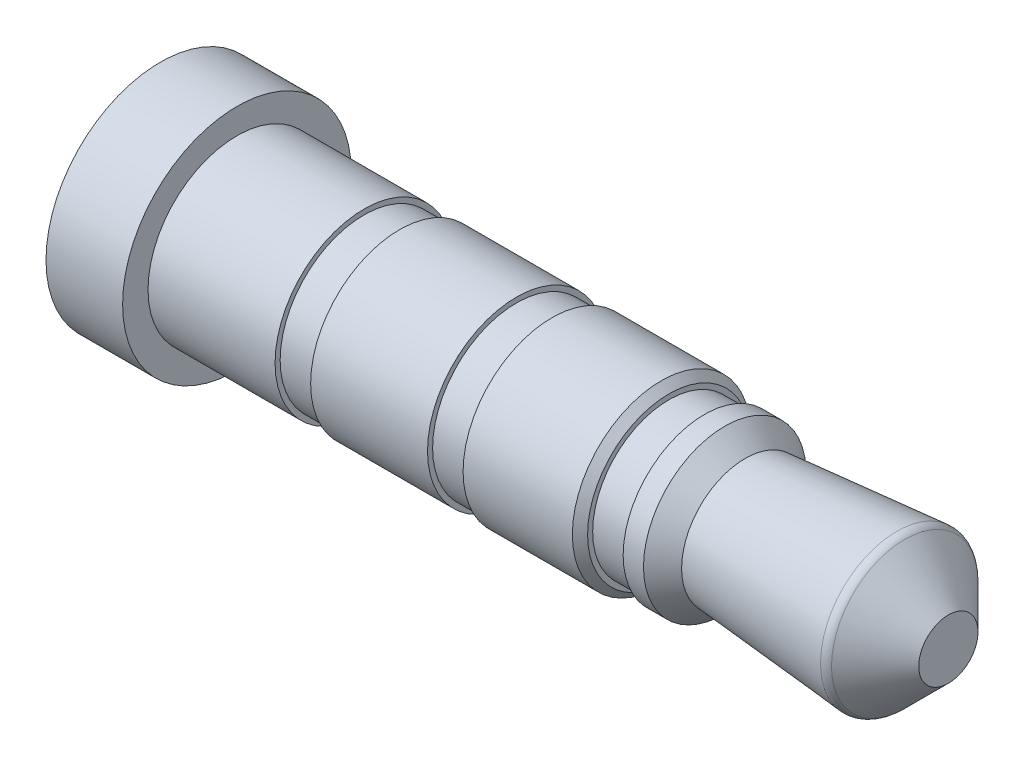
ISO-10303-21;
HEADER;
FILE_DESCRIPTION(('STEP AP214'),'2;1');
FILE_NAME('part.step','',(''),(''),'','','');
FILE_SCHEMA(('AUTOMOTIVE_DESIGN { 1 0 10303 214 1 1 1 1 }'));
ENDSEC;
DATA;
#1=APPLICATION_CONTEXT('core data for automotive mechanical design processes');
#2=APPLICATION_PROTOCOL_DEFINITION('international standard','automotive_design',2000,#1);
#3=PRODUCT_CONTEXT('',#1,'mechanical');
#4=PRODUCT('Part','Part','',(#3));
#5=PRODUCT_RELATED_PRODUCT_CATEGORY('part','',(#4));
#6=PRODUCT_DEFINITION_FORMATION('','',#4);
#7=PRODUCT_DEFINITION_CONTEXT('part definition',#1,'design');
#8=PRODUCT_DEFINITION('design','',#6,#7);
#9=PRODUCT_DEFINITION_SHAPE('','',#8);
#10=(LENGTH_UNIT() NAMED_UNIT(*) SI_UNIT(.MILLI.,.METRE.));
#11=(NAMED_UNIT(*) PLANE_ANGLE_UNIT() SI_UNIT($,.RADIAN.));
#12=(NAMED_UNIT(*) SI_UNIT($,.STERADIAN.) SOLID_ANGLE_UNIT());
#13=UNCERTAINTY_MEASURE_WITH_UNIT(LENGTH_MEASURE(1.E-05),#10,'distance_accuracy_value','');
#14=(GEOMETRIC_REPRESENTATION_CONTEXT(3) GLOBAL_UNCERTAINTY_ASSIGNED_CONTEXT((#13)) GLOBAL_UNIT_ASSIGNED_CONTEXT((#10,
#11,#12)) REPRESENTATION_CONTEXT('',''));
#15=CARTESIAN_POINT('',(0.,0.,0.));
#16=DIRECTION('',(0.,0.,1.));
#17=DIRECTION('',(1.,0.,0.));
#18=AXIS2_PLACEMENT_3D('',#15,#16,#17);
#19=CARTESIAN_POINT('',(-0.5000000000001,3.108578643763,-2.299999999999));
#20=DIRECTION('',(1.,0.,0.));
#21=DIRECTION('',(0.,0.,-1.));
#22=AXIS2_PLACEMENT_3D('',#19,#20,#21);
#23=PLANE('',#22);
#24=CARTESIAN_POINT('',(-0.50000000004502,3.4,-2.299999999999));
#25=DIRECTION('',(-1.,0.,0.));
#26=DIRECTION('',(0.,0.,1.));
#27=AXIS2_PLACEMENT_3D('',#24,#25,#26);
#28=CIRCLE('',#27,0.582842712447837);
#29=CARTESIAN_POINT('',(-0.50000000004502,3.4,-1.71715728755116));
#30=VERTEX_POINT('',#29);
#31=EDGE_CURVE('E18',#30,#30,#28,.T.);
#32=ORIENTED_EDGE('',*,*,#31,.F.);
#33=EDGE_LOOP('',(#32));
#34=FACE_BOUND('',#33,.T.);
#35=ADVANCED_FACE('F15',(#34),#23,.T.);
#36=CARTESIAN_POINT('',(-1.35857864370337,3.4,-2.299999999999));
#37=DIRECTION('',(-1.,0.,0.));
#38=DIRECTION('',(0.,0.,1.));
#39=AXIS2_PLACEMENT_3D('',#36,#37,#38);
#40=CONICAL_SURFACE('',#39,1.44142135604934,0.785398163364345);
#41=ORIENTED_EDGE('',*,*,#31,.T.);
#42=EDGE_LOOP('',(#41));
#43=FACE_BOUND('',#42,.T.);
#44=CARTESIAN_POINT('',(-1.35857864376269,3.4,-2.299999999999));
#45=DIRECTION('',(-1.,0.,0.));
#46=DIRECTION('',(0.,0.,-1.));
#47=AXIS2_PLACEMENT_3D('',#44,#45,#46);
#48=CIRCLE('',#47,1.44142135623731);
#49=CARTESIAN_POINT('',(-1.35857864376269,3.4,-3.74142135623631));
#50=VERTEX_POINT('',#49);
#51=EDGE_CURVE('E30',#50,#50,#48,.T.);
#52=ORIENTED_EDGE('',*,*,#51,.F.);
#53=EDGE_LOOP('',(#52));
#54=FACE_BOUND('',#53,.T.);
#55=ADVANCED_FACE('F90',(#43,#54),#40,.T.);
#56=CARTESIAN_POINT('',(-1.5,3.4,-2.299999999999));
#57=DIRECTION('',(-1.,0.,0.));
#58=DIRECTION('',(0.,0.,-1.));
#59=AXIS2_PLACEMENT_3D('',#56,#57,#58);
#60=TOROIDAL_SURFACE('',#59,1.3,0.2);
#61=ORIENTED_EDGE('',*,*,#51,.T.);
#62=EDGE_LOOP('',(#61));
#63=FACE_BOUND('',#62,.T.);
#64=CARTESIAN_POINT('',(-1.51665508855103,3.4,-2.299999999999));
#65=DIRECTION('',(1.,0.,0.));
#66=DIRECTION('',(0.,-1.,0.));
#67=AXIS2_PLACEMENT_3D('',#64,#65,#66);
#68=CIRCLE('',#67,1.4993053135947);
#69=CARTESIAN_POINT('',(-1.51665508855103,1.9006946864053,-2.299999999999));
#70=VERTEX_POINT('',#69);
#71=EDGE_CURVE('E79',#70,#70,#68,.F.);
#72=ORIENTED_EDGE('',*,*,#71,.F.);
#73=EDGE_LOOP('',(#72));
#74=FACE_BOUND('',#73,.T.);
#75=ADVANCED_FACE('F86',(#63,#74),#60,.T.);
#76=CARTESIAN_POINT('',(-1.51665508866472,3.4,-2.299999999999));
#77=DIRECTION('',(1.,0.,0.));
#78=DIRECTION('',(0.,0.,-1.));
#79=AXIS2_PLACEMENT_3D('',#76,#77,#78);
#80=CONICAL_SURFACE('',#79,1.49930531358049,0.0833719941546523);
#81=ORIENTED_EDGE('',*,*,#71,.T.);
#82=EDGE_LOOP('',(#81));
#83=FACE_BOUND('',#82,.T.);
#84=CARTESIAN_POINT('',(-4.50000000006412,3.4,-2.299999999999));
#85=DIRECTION('',(-1.,0.,0.));
#86=DIRECTION('',(0.,-1.,0.));
#87=AXIS2_PLACEMENT_3D('',#84,#85,#86);
#88=CIRCLE('',#87,1.24999999997126);
#89=CARTESIAN_POINT('',(-4.50000000006412,2.15000000002874,-2.299999999999));
#90=VERTEX_POINT('',#89);
#91=EDGE_CURVE('E74',#90,#90,#88,.T.);
#92=ORIENTED_EDGE('',*,*,#91,.F.);
#93=EDGE_LOOP('',(#92));
#94=FACE_BOUND('',#93,.T.);
#95=ADVANCED_FACE('F89',(#83,#94),#80,.T.);
#96=CARTESIAN_POINT('',(-4.89999999990687,3.4,-2.299999999999));
#97=DIRECTION('',(-1.,0.,0.));
#98=DIRECTION('',(0.,0.,1.));
#99=AXIS2_PLACEMENT_3D('',#96,#97,#98);
#100=CONICAL_SURFACE('',#99,1.5999999998834,0.718829999631685);
#101=ORIENTED_EDGE('',*,*,#91,.T.);
#102=EDGE_LOOP('',(#101));
#103=FACE_BOUND('',#102,.T.);
#104=CARTESIAN_POINT('',(-4.9,3.4,-2.299999999999));
#105=DIRECTION('',(-1.,0.,0.));
#106=DIRECTION('',(0.,0.,1.));
#107=AXIS2_PLACEMENT_3D('',#104,#105,#106);
#108=CIRCLE('',#107,1.6);
#109=CARTESIAN_POINT('',(-4.9,3.4,-0.699999999999));
#110=VERTEX_POINT('',#109);
#111=EDGE_CURVE('E70',#110,#110,#108,.T.);
#112=ORIENTED_EDGE('',*,*,#111,.F.);
#113=EDGE_LOOP('',(#112));
#114=FACE_BOUND('',#113,.T.);
#115=ADVANCED_FACE('F170',(#103,#114),#100,.T.);
#116=CARTESIAN_POINT('',(-5.1,3.4,-2.299999999999));
#117=DIRECTION('',(-1.,0.,0.));
#118=DIRECTION('',(0.,0.,1.));
#119=AXIS2_PLACEMENT_3D('',#116,#117,#118);
#120=CYLINDRICAL_SURFACE('',#119,1.6);
#121=ORIENTED_EDGE('',*,*,#111,.T.);
#122=EDGE_LOOP('',(#121));
#123=FACE_BOUND('',#122,.T.);
#124=CARTESIAN_POINT('',(-5.3,3.4,-2.299999999999));
#125=DIRECTION('',(-1.,0.,0.));
#126=DIRECTION('',(0.,0.,1.));
#127=AXIS2_PLACEMENT_3D('',#124,#125,#126);
#128=CIRCLE('',#127,1.6);
#129=CARTESIAN_POINT('',(-5.3,3.4,-0.699999999999));
#130=VERTEX_POINT('',#129);
#131=EDGE_CURVE('E68',#130,#130,#128,.T.);
#132=ORIENTED_EDGE('',*,*,#131,.F.);
#133=EDGE_LOOP('',(#132));
#134=FACE_BOUND('',#133,.T.);
#135=ADVANCED_FACE('F167',(#123,#134),#120,.T.);
#136=CARTESIAN_POINT('',(-5.3,1.85,-2.299999999999));
#137=DIRECTION('',(-1.,0.,0.));
#138=DIRECTION('',(0.,0.,1.));
#139=AXIS2_PLACEMENT_3D('',#136,#137,#138);
#140=PLANE('',#139);
#141=CARTESIAN_POINT('',(-5.3,3.4,-2.299999999999));
#142=DIRECTION('',(-1.,0.,0.));
#143=DIRECTION('',(0.,0.,1.));
#144=AXIS2_PLACEMENT_3D('',#141,#142,#143);
#145=CIRCLE('',#144,1.5);
#146=CARTESIAN_POINT('',(-5.3,3.4,-0.799999999999));
#147=VERTEX_POINT('',#146);
#148=EDGE_CURVE('E66',#147,#147,#145,.T.);
#149=ORIENTED_EDGE('',*,*,#148,.F.);
#150=EDGE_LOOP('',(#149));
#151=FACE_BOUND('',#150,.T.);
#152=ORIENTED_EDGE('',*,*,#131,.T.);
#153=EDGE_LOOP('',(#152));
#154=FACE_BOUND('',#153,.T.);
#155=ADVANCED_FACE('F163',(#151,#154),#140,.T.);
#156=CARTESIAN_POINT('',(-5.65,3.4,-2.299999999999));
#157=DIRECTION('',(-1.,0.,0.));
#158=DIRECTION('',(0.,0.,1.));
#159=AXIS2_PLACEMENT_3D('',#156,#157,#158);
#160=CYLINDRICAL_SURFACE('',#159,1.5);
#161=ORIENTED_EDGE('',*,*,#148,.T.);
#162=EDGE_LOOP('',(#161));
#163=FACE_BOUND('',#162,.T.);
#164=CARTESIAN_POINT('',(-6.,3.4,-2.299999999999));
#165=DIRECTION('',(-1.,0.,0.));
#166=DIRECTION('',(0.,0.,1.));
#167=AXIS2_PLACEMENT_3D('',#164,#165,#166);
#168=CIRCLE('',#167,1.5);
#169=CARTESIAN_POINT('',(-6.,3.4,-0.799999999999));
#170=VERTEX_POINT('',#169);
#171=EDGE_CURVE('E63',#170,#170,#168,.T.);
#172=ORIENTED_EDGE('',*,*,#171,.F.);
#173=EDGE_LOOP('',(#172));
#174=FACE_BOUND('',#173,.T.);
#175=ADVANCED_FACE('F159',(#163,#174),#160,.T.);
#176=CARTESIAN_POINT('',(-6.,1.85,-2.299999999999));
#177=DIRECTION('',(1.,0.,0.));
#178=DIRECTION('',(0.,0.,-1.));
#179=AXIS2_PLACEMENT_3D('',#176,#177,#178);
#180=PLANE('',#179);
#181=ORIENTED_EDGE('',*,*,#171,.T.);
#182=EDGE_LOOP('',(#181));
#183=FACE_BOUND('',#182,.T.);
#184=CARTESIAN_POINT('',(-5.99999999997181,3.4,-2.299999999999));
#185=DIRECTION('',(-1.,0.,0.));
#186=DIRECTION('',(0.,0.,1.));
#187=AXIS2_PLACEMENT_3D('',#184,#185,#186);
#188=CIRCLE('',#187,1.59999999999709);
#189=CARTESIAN_POINT('',(-5.99999999997181,3.4,-0.700000000001911));
#190=VERTEX_POINT('',#189);
#191=EDGE_CURVE('E60',#190,#190,#188,.T.);
#192=ORIENTED_EDGE('',*,*,#191,.F.);
#193=EDGE_LOOP('',(#192));
#194=FACE_BOUND('',#193,.T.);
#195=ADVANCED_FACE('F155',(#183,#194),#180,.T.);
#196=CARTESIAN_POINT('',(-6.149999999991,3.4,-2.299999999999));
#197=DIRECTION('',(-1.,0.,0.));
#198=DIRECTION('',(0.,0.,1.));
#199=AXIS2_PLACEMENT_3D('',#196,#197,#198);
#200=CONICAL_SURFACE('',#199,1.75000000001628,0.785398163397448);
#201=ORIENTED_EDGE('',*,*,#191,.T.);
#202=EDGE_LOOP('',(#201));
#203=FACE_BOUND('',#202,.T.);
#204=CARTESIAN_POINT('',(-6.15,3.4,-2.299999999999));
#205=DIRECTION('',(-1.,0.,0.));
#206=DIRECTION('',(0.,0.,1.));
#207=AXIS2_PLACEMENT_3D('',#204,#205,#206);
#208=CIRCLE('',#207,1.75);
#209=CARTESIAN_POINT('',(-6.15,3.4,-0.549999999999));
#210=VERTEX_POINT('',#209);
#211=EDGE_CURVE('E59',#210,#210,#208,.T.);
#212=ORIENTED_EDGE('',*,*,#211,.F.);
#213=EDGE_LOOP('',(#212));
#214=FACE_BOUND('',#213,.T.);
#215=ADVANCED_FACE('F151',(#203,#214),#200,.T.);
#216=CARTESIAN_POINT('',(-7.225,3.4,-2.299999999999));
#217=DIRECTION('',(-1.,0.,0.));
#218=DIRECTION('',(0.,0.,1.));
#219=AXIS2_PLACEMENT_3D('',#216,#217,#218);
#220=CYLINDRICAL_SURFACE('',#219,1.75);
#221=ORIENTED_EDGE('',*,*,#211,.T.);
#222=EDGE_LOOP('',(#221));
#223=FACE_BOUND('',#222,.T.);
#224=CARTESIAN_POINT('',(-8.3,3.4,-2.299999999999));
#225=DIRECTION('',(-1.,0.,0.));
#226=DIRECTION('',(0.,0.,1.));
#227=AXIS2_PLACEMENT_3D('',#224,#225,#226);
#228=CIRCLE('',#227,1.75);
#229=CARTESIAN_POINT('',(-8.3,3.4,-0.549999999999));
#230=VERTEX_POINT('',#229);
#231=EDGE_CURVE('E56',#230,#230,#228,.T.);
#232=ORIENTED_EDGE('',*,*,#231,.F.);
#233=EDGE_LOOP('',(#232));
#234=FACE_BOUND('',#233,.T.);
#235=ADVANCED_FACE('F147',(#223,#234),#220,.T.);
#236=CARTESIAN_POINT('',(-8.3,1.7,-2.299999999999));
#237=DIRECTION('',(-1.,0.,0.));
#238=DIRECTION('',(0.,0.,1.));
#239=AXIS2_PLACEMENT_3D('',#236,#237,#238);
#240=PLANE('',#239);
#241=CARTESIAN_POINT('',(-8.3,3.4,-2.299999999999));
#242=DIRECTION('',(-1.,0.,0.));
#243=DIRECTION('',(0.,0.,1.));
#244=AXIS2_PLACEMENT_3D('',#241,#242,#243);
#245=CIRCLE('',#244,1.65);
#246=CARTESIAN_POINT('',(-8.3,3.4,-0.649999999999));
#247=VERTEX_POINT('',#246);
#248=EDGE_CURVE('E53',#247,#247,#245,.T.);
#249=ORIENTED_EDGE('',*,*,#248,.F.);
#250=EDGE_LOOP('',(#249));
#251=FACE_BOUND('',#250,.T.);
#252=ORIENTED_EDGE('',*,*,#231,.T.);
#253=EDGE_LOOP('',(#252));
#254=FACE_BOUND('',#253,.T.);
#255=ADVANCED_FACE('F143',(#251,#254),#240,.T.);
#256=CARTESIAN_POINT('',(-8.65,3.4,-2.299999999999));
#257=DIRECTION('',(-1.,0.,0.));
#258=DIRECTION('',(0.,0.,1.));
#259=AXIS2_PLACEMENT_3D('',#256,#257,#258);
#260=CYLINDRICAL_SURFACE('',#259,1.65);
#261=ORIENTED_EDGE('',*,*,#248,.T.);
#262=EDGE_LOOP('',(#261));
#263=FACE_BOUND('',#262,.T.);
#264=CARTESIAN_POINT('',(-9.,3.4,-2.299999999999));
#265=DIRECTION('',(-1.,0.,0.));
#266=DIRECTION('',(0.,0.,1.));
#267=AXIS2_PLACEMENT_3D('',#264,#265,#266);
#268=CIRCLE('',#267,1.65);
#269=CARTESIAN_POINT('',(-9.,3.4,-0.649999999999));
#270=VERTEX_POINT('',#269);
#271=EDGE_CURVE('E50',#270,#270,#268,.T.);
#272=ORIENTED_EDGE('',*,*,#271,.F.);
#273=EDGE_LOOP('',(#272));
#274=FACE_BOUND('',#273,.T.);
#275=ADVANCED_FACE('F139',(#263,#274),#260,.T.);
#276=CARTESIAN_POINT('',(-9.,1.7,-2.299999999999));
#277=DIRECTION('',(1.,0.,0.));
#278=DIRECTION('',(0.,0.,-1.));
#279=AXIS2_PLACEMENT_3D('',#276,#277,#278);
#280=PLANE('',#279);
#281=ORIENTED_EDGE('',*,*,#271,.T.);
#282=EDGE_LOOP('',(#281));
#283=FACE_BOUND('',#282,.T.);
#284=CARTESIAN_POINT('',(-9.,3.4,-2.299999999999));
#285=DIRECTION('',(-1.,0.,0.));
#286=DIRECTION('',(0.,0.,1.));
#287=AXIS2_PLACEMENT_3D('',#284,#285,#286);
#288=CIRCLE('',#287,1.75);
#289=CARTESIAN_POINT('',(-9.,3.4,-0.549999999999));
#290=VERTEX_POINT('',#289);
#291=EDGE_CURVE('E47',#290,#290,#288,.T.);
#292=ORIENTED_EDGE('',*,*,#291,.F.);
#293=EDGE_LOOP('',(#292));
#294=FACE_BOUND('',#293,.T.);
#295=ADVANCED_FACE('F135',(#283,#294),#280,.T.);
#296=CARTESIAN_POINT('',(-10.15,3.4,-2.299999999999));
#297=DIRECTION('',(-1.,0.,0.));
#298=DIRECTION('',(0.,0.,1.));
#299=AXIS2_PLACEMENT_3D('',#296,#297,#298);
#300=CYLINDRICAL_SURFACE('',#299,1.75);
#301=ORIENTED_EDGE('',*,*,#291,.T.);
#302=EDGE_LOOP('',(#301));
#303=FACE_BOUND('',#302,.T.);
#304=CARTESIAN_POINT('',(-11.3,3.4,-2.299999999999));
#305=DIRECTION('',(-1.,0.,0.));
#306=DIRECTION('',(0.,0.,1.));
#307=AXIS2_PLACEMENT_3D('',#304,#305,#306);
#308=CIRCLE('',#307,1.75);
#309=CARTESIAN_POINT('',(-11.3,3.4,-0.549999999999));
#310=VERTEX_POINT('',#309);
#311=EDGE_CURVE('E44',#310,#310,#308,.T.);
#312=ORIENTED_EDGE('',*,*,#311,.F.);
#313=EDGE_LOOP('',(#312));
#314=FACE_BOUND('',#313,.T.);
#315=ADVANCED_FACE('F131',(#303,#314),#300,.T.);
#316=CARTESIAN_POINT('',(-11.3,1.7,-2.299999999999));
#317=DIRECTION('',(-1.,0.,0.));
#318=DIRECTION('',(0.,0.,1.));
#319=AXIS2_PLACEMENT_3D('',#316,#317,#318);
#320=PLANE('',#319);
#321=CARTESIAN_POINT('',(-11.3,3.4,-2.299999999999));
#322=DIRECTION('',(-1.,0.,0.));
#323=DIRECTION('',(0.,0.,1.));
#324=AXIS2_PLACEMENT_3D('',#321,#322,#323);
#325=CIRCLE('',#324,1.65);
#326=CARTESIAN_POINT('',(-11.3,3.4,-0.649999999999));
#327=VERTEX_POINT('',#326);
#328=EDGE_CURVE('E41',#327,#327,#325,.T.);
#329=ORIENTED_EDGE('',*,*,#328,.F.);
#330=EDGE_LOOP('',(#329));
#331=FACE_BOUND('',#330,.T.);
#332=ORIENTED_EDGE('',*,*,#311,.T.);
#333=EDGE_LOOP('',(#332));
#334=FACE_BOUND('',#333,.T.);
#335=ADVANCED_FACE('F127',(#331,#334),#320,.T.);
#336=CARTESIAN_POINT('',(-11.65,3.4,-2.299999999999));
#337=DIRECTION('',(-1.,0.,0.));
#338=DIRECTION('',(0.,0.,1.));
#339=AXIS2_PLACEMENT_3D('',#336,#337,#338);
#340=CYLINDRICAL_SURFACE('',#339,1.65);
#341=ORIENTED_EDGE('',*,*,#328,.T.);
#342=EDGE_LOOP('',(#341));
#343=FACE_BOUND('',#342,.T.);
#344=CARTESIAN_POINT('',(-12.,3.4,-2.299999999999));
#345=DIRECTION('',(-1.,0.,0.));
#346=DIRECTION('',(0.,0.,1.));
#347=AXIS2_PLACEMENT_3D('',#344,#345,#346);
#348=CIRCLE('',#347,1.65);
#349=CARTESIAN_POINT('',(-12.,3.4,-0.649999999999));
#350=VERTEX_POINT('',#349);
#351=EDGE_CURVE('E38',#350,#350,#348,.T.);
#352=ORIENTED_EDGE('',*,*,#351,.F.);
#353=EDGE_LOOP('',(#352));
#354=FACE_BOUND('',#353,.T.);
#355=ADVANCED_FACE('F123',(#343,#354),#340,.T.);
#356=CARTESIAN_POINT('',(-12.,1.7,-2.299999999999));
#357=DIRECTION('',(1.,0.,0.));
#358=DIRECTION('',(0.,0.,-1.));
#359=AXIS2_PLACEMENT_3D('',#356,#357,#358);
#360=PLANE('',#359);
#361=ORIENTED_EDGE('',*,*,#351,.T.);
#362=EDGE_LOOP('',(#361));
#363=FACE_BOUND('',#362,.T.);
#364=CARTESIAN_POINT('',(-12.,3.4,-2.299999999999));
#365=DIRECTION('',(-1.,0.,0.));
#366=DIRECTION('',(0.,0.,1.));
#367=AXIS2_PLACEMENT_3D('',#364,#365,#366);
#368=CIRCLE('',#367,1.75);
#369=CARTESIAN_POINT('',(-12.,3.4,-0.549999999999));
#370=VERTEX_POINT('',#369);
#371=EDGE_CURVE('E35',#370,#370,#368,.T.);
#372=ORIENTED_EDGE('',*,*,#371,.F.);
#373=EDGE_LOOP('',(#372));
#374=FACE_BOUND('',#373,.T.);
#375=ADVANCED_FACE('F119',(#363,#374),#360,.T.);
#376=CARTESIAN_POINT('',(-13.25,3.4,-2.299999999999));
#377=DIRECTION('',(-1.,0.,0.));
#378=DIRECTION('',(0.,0.,1.));
#379=AXIS2_PLACEMENT_3D('',#376,#377,#378);
#380=CYLINDRICAL_SURFACE('',#379,1.75);
#381=ORIENTED_EDGE('',*,*,#371,.T.);
#382=EDGE_LOOP('',(#381));
#383=FACE_BOUND('',#382,.T.);
#384=CARTESIAN_POINT('',(-14.5,3.4,-2.299999999999));
#385=DIRECTION('',(-1.,0.,0.));
#386=DIRECTION('',(0.,0.,1.));
#387=AXIS2_PLACEMENT_3D('',#384,#385,#386);
#388=CIRCLE('',#387,1.75);
#389=CARTESIAN_POINT('',(-14.5,3.4,-0.549999999999));
#390=VERTEX_POINT('',#389);
#391=EDGE_CURVE('E27',#390,#390,#388,.T.);
#392=ORIENTED_EDGE('',*,*,#391,.F.);
#393=EDGE_LOOP('',(#392));
#394=FACE_BOUND('',#393,.T.);
#395=ADVANCED_FACE('F115',(#383,#394),#380,.T.);
#396=CARTESIAN_POINT('',(-14.5,1.4,-2.299999999999));
#397=DIRECTION('',(1.,0.,0.));
#398=DIRECTION('',(0.,0.,-1.));
#399=AXIS2_PLACEMENT_3D('',#396,#397,#398);
#400=PLANE('',#399);
#401=ORIENTED_EDGE('',*,*,#391,.T.);
#402=EDGE_LOOP('',(#401));
#403=FACE_BOUND('',#402,.T.);
#404=CARTESIAN_POINT('',(-14.5,3.4,-2.299999999999));
#405=DIRECTION('',(-1.,0.,0.));
#406=DIRECTION('',(0.,0.,1.));
#407=AXIS2_PLACEMENT_3D('',#404,#405,#406);
#408=CIRCLE('',#407,2.25);
#409=CARTESIAN_POINT('',(-14.5,3.4,-0.0499999999990001));
#410=VERTEX_POINT('',#409);
#411=EDGE_CURVE('E22',#410,#410,#408,.T.);
#412=ORIENTED_EDGE('',*,*,#411,.F.);
#413=EDGE_LOOP('',(#412));
#414=FACE_BOUND('',#413,.T.);
#415=ADVANCED_FACE('F109',(#403,#414),#400,.T.);
#416=CARTESIAN_POINT('',(-14.75,3.4,-2.299999999999));
#417=DIRECTION('',(-1.,0.,0.));
#418=DIRECTION('',(0.,0.,1.));
#419=AXIS2_PLACEMENT_3D('',#416,#417,#418);
#420=CYLINDRICAL_SURFACE('',#419,2.25);
#421=ORIENTED_EDGE('',*,*,#411,.T.);
#422=EDGE_LOOP('',(#421));
#423=FACE_BOUND('',#422,.T.);
#424=CARTESIAN_POINT('',(-16.00779476817,3.4,-2.299999999999));
#425=DIRECTION('',(-1.,0.,0.));
#426=DIRECTION('',(0.,0.,1.));
#427=AXIS2_PLACEMENT_3D('',#424,#425,#426);
#428=CIRCLE('',#427,2.25);
#429=CARTESIAN_POINT('',(-16.00779476817,3.4,-0.0499999999990001));
#430=VERTEX_POINT('',#429);
#431=EDGE_CURVE('E10',#430,#430,#428,.T.);
#432=ORIENTED_EDGE('',*,*,#431,.F.);
#433=EDGE_LOOP('',(#432));
#434=FACE_BOUND('',#433,.T.);
#435=ADVANCED_FACE('F104',(#423,#434),#420,.T.);
#436=CARTESIAN_POINT('',(-16.00779476817,1.9,-2.299999999999));
#437=DIRECTION('',(-1.,0.,0.));
#438=DIRECTION('',(0.,0.,1.));
#439=AXIS2_PLACEMENT_3D('',#436,#437,#438);
#440=PLANE('',#439);
#441=ORIENTED_EDGE('',*,*,#431,.T.);
#442=EDGE_LOOP('',(#441));
#443=FACE_BOUND('',#442,.T.);
#444=ADVANCED_FACE('F102',(#443),#440,.T.);
#445=CLOSED_SHELL('',(#35,#55,#75,#95,#115,#135,#155,#175,#195,#215,#235,#255,#275,#295,#315,
#335,#355,#375,#395,#415,#435,#444));
#446=MANIFOLD_SOLID_BREP('B1',#445);
#447=ADVANCED_BREP_SHAPE_REPRESENTATION('',(#18,#446),#14);
#448=SHAPE_DEFINITION_REPRESENTATION(#9,#447);
ENDSEC;
END-ISO-10303-21;
